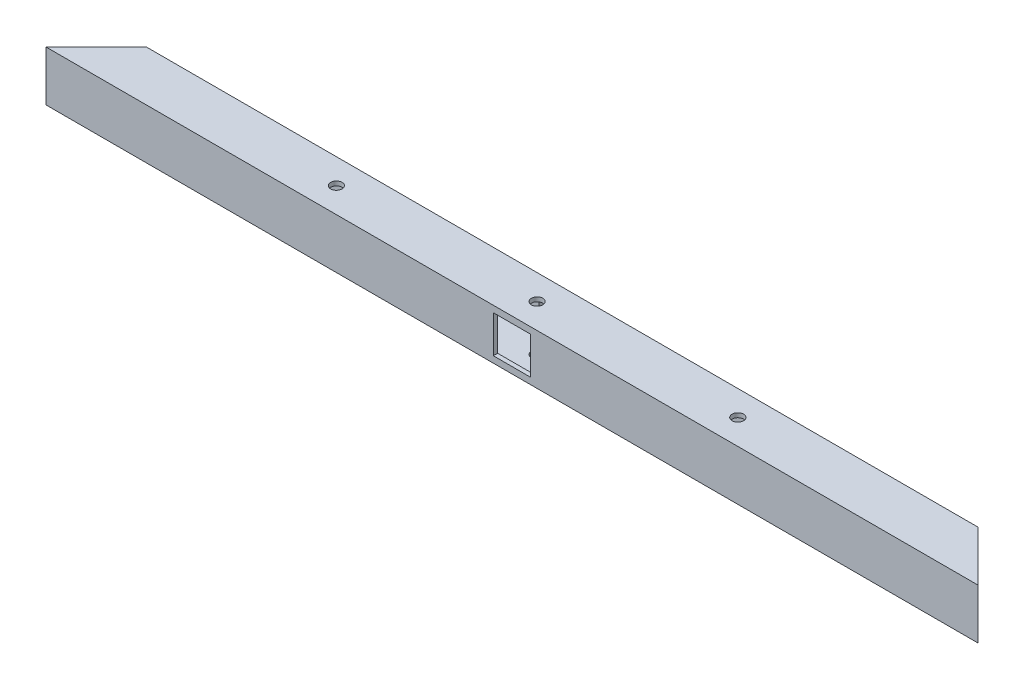
ISO-10303-21;
HEADER;
FILE_DESCRIPTION(('STEP AP214'),'2;1');
FILE_NAME('part.step','',(''),(''),'','','');
FILE_SCHEMA(('AUTOMOTIVE_DESIGN { 1 0 10303 214 1 1 1 1 }'));
ENDSEC;
DATA;
#1=APPLICATION_CONTEXT('core data for automotive mechanical design processes');
#2=APPLICATION_PROTOCOL_DEFINITION('international standard','automotive_design',2000,#1);
#3=PRODUCT_CONTEXT('',#1,'mechanical');
#4=PRODUCT('Part','Part','',(#3));
#5=PRODUCT_RELATED_PRODUCT_CATEGORY('part','',(#4));
#6=PRODUCT_DEFINITION_FORMATION('','',#4);
#7=PRODUCT_DEFINITION_CONTEXT('part definition',#1,'design');
#8=PRODUCT_DEFINITION('design','',#6,#7);
#9=PRODUCT_DEFINITION_SHAPE('','',#8);
#10=(LENGTH_UNIT() NAMED_UNIT(*) SI_UNIT(.MILLI.,.METRE.));
#11=(NAMED_UNIT(*) PLANE_ANGLE_UNIT() SI_UNIT($,.RADIAN.));
#12=(NAMED_UNIT(*) SI_UNIT($,.STERADIAN.) SOLID_ANGLE_UNIT());
#13=UNCERTAINTY_MEASURE_WITH_UNIT(LENGTH_MEASURE(1.E-05),#10,'distance_accuracy_value','');
#14=(GEOMETRIC_REPRESENTATION_CONTEXT(3) GLOBAL_UNCERTAINTY_ASSIGNED_CONTEXT((#13)) GLOBAL_UNIT_ASSIGNED_CONTEXT((#10,
#11,#12)) REPRESENTATION_CONTEXT('',''));
#15=CARTESIAN_POINT('',(0.,0.,0.));
#16=DIRECTION('',(0.,0.,1.));
#17=DIRECTION('',(1.,0.,0.));
#18=AXIS2_PLACEMENT_3D('',#15,#16,#17);
#19=CARTESIAN_POINT('',(325.,35.,12.5));
#20=DIRECTION('',(-0.707106781186543,0.,0.707106781186552));
#21=DIRECTION('',(0.707106781186552,0.,0.707106781186543));
#22=AXIS2_PLACEMENT_3D('',#19,#20,#21);
#23=PLANE('',#22);
#24=DIRECTION('',(-0.707106781186552,0.,-0.707106781186543));
#25=VECTOR('',#24,1.);
#26=CARTESIAN_POINT('',(325.,0.,12.5));
#27=LINE('',#26,#25);
#28=CARTESIAN_POINT('',(325.,0.,12.5));
#29=VERTEX_POINT('',#28);
#30=CARTESIAN_POINT('',(290.,0.,-22.5));
#31=VERTEX_POINT('',#30);
#32=EDGE_CURVE('E235',#29,#31,#27,.T.);
#33=ORIENTED_EDGE('',*,*,#32,.T.);
#34=DIRECTION('',(0.,-1.,0.));
#35=VECTOR('',#34,1.);
#36=CARTESIAN_POINT('',(290.,35.,-22.5));
#37=LINE('',#36,#35);
#38=CARTESIAN_POINT('',(290.,35.,-22.5));
#39=VERTEX_POINT('',#38);
#40=EDGE_CURVE('E268',#39,#31,#37,.T.);
#41=ORIENTED_EDGE('',*,*,#40,.F.);
#42=DIRECTION('',(-0.707106781186552,0.,-0.707106781186543));
#43=VECTOR('',#42,1.);
#44=CARTESIAN_POINT('',(325.,35.,12.5));
#45=LINE('',#44,#43);
#46=CARTESIAN_POINT('',(325.,35.,12.5));
#47=VERTEX_POINT('',#46);
#48=EDGE_CURVE('E242',#47,#39,#45,.T.);
#49=ORIENTED_EDGE('',*,*,#48,.F.);
#50=DIRECTION('',(0.,-1.,0.));
#51=VECTOR('',#50,1.);
#52=CARTESIAN_POINT('',(325.,35.,12.5));
#53=LINE('',#52,#51);
#54=EDGE_CURVE('E252',#47,#29,#53,.T.);
#55=ORIENTED_EDGE('',*,*,#54,.T.);
#56=EDGE_LOOP('',(#33,#41,#49,#55));
#57=FACE_BOUND('',#56,.T.);
#58=DIRECTION('',(-0.707106781186552,0.,-0.707106781186543));
#59=VECTOR('',#58,1.);
#60=CARTESIAN_POINT('',(156.249999999998,3.,-156.25));
#61=LINE('',#60,#59);
#62=CARTESIAN_POINT('',(322.,3.,9.50000000000001));
#63=VERTEX_POINT('',#62);
#64=CARTESIAN_POINT('',(293.,3.,-19.5));
#65=VERTEX_POINT('',#64);
#66=EDGE_CURVE('E208',#63,#65,#61,.T.);
#67=ORIENTED_EDGE('',*,*,#66,.F.);
#68=DIRECTION('',(0.,-1.,0.));
#69=VECTOR('',#68,1.);
#70=CARTESIAN_POINT('',(322.,35.,9.50000000000001));
#71=LINE('',#70,#69);
#72=CARTESIAN_POINT('',(322.,32.,9.50000000000001));
#73=VERTEX_POINT('',#72);
#74=EDGE_CURVE('E220',#73,#63,#71,.T.);
#75=ORIENTED_EDGE('',*,*,#74,.F.);
#76=DIRECTION('',(-0.707106781186552,0.,-0.707106781186543));
#77=VECTOR('',#76,1.);
#78=CARTESIAN_POINT('',(156.249999999998,32.,-156.25));
#79=LINE('',#78,#77);
#80=CARTESIAN_POINT('',(293.,32.,-19.5));
#81=VERTEX_POINT('',#80);
#82=EDGE_CURVE('E216',#73,#81,#79,.T.);
#83=ORIENTED_EDGE('',*,*,#82,.T.);
#84=DIRECTION('',(0.,-1.,0.));
#85=VECTOR('',#84,1.);
#86=CARTESIAN_POINT('',(293.,35.,-19.5));
#87=LINE('',#86,#85);
#88=EDGE_CURVE('E226',#81,#65,#87,.T.);
#89=ORIENTED_EDGE('',*,*,#88,.T.);
#90=EDGE_LOOP('',(#67,#75,#83,#89));
#91=FACE_BOUND('',#90,.T.);
#92=ADVANCED_FACE('F37',(#57,#91),#23,.F.);
#93=CARTESIAN_POINT('',(-325.,35.,12.5));
#94=DIRECTION('',(0.707106781186549,0.,0.707106781186546));
#95=DIRECTION('',(0.707106781186546,0.,-0.707106781186549));
#96=AXIS2_PLACEMENT_3D('',#93,#94,#95);
#97=PLANE('',#96);
#98=DIRECTION('',(-0.707106781186546,0.,0.707106781186549));
#99=VECTOR('',#98,1.);
#100=CARTESIAN_POINT('',(-325.,0.,12.5));
#101=LINE('',#100,#99);
#102=CARTESIAN_POINT('',(-290.,0.,-22.5));
#103=VERTEX_POINT('',#102);
#104=CARTESIAN_POINT('',(-325.,0.,12.5));
#105=VERTEX_POINT('',#104);
#106=EDGE_CURVE('E257',#103,#105,#101,.T.);
#107=ORIENTED_EDGE('',*,*,#106,.T.);
#108=DIRECTION('',(0.,-1.,0.));
#109=VECTOR('',#108,1.);
#110=CARTESIAN_POINT('',(-325.,35.,12.5));
#111=LINE('',#110,#109);
#112=CARTESIAN_POINT('',(-325.,35.,12.5));
#113=VERTEX_POINT('',#112);
#114=EDGE_CURVE('E262',#113,#105,#111,.T.);
#115=ORIENTED_EDGE('',*,*,#114,.F.);
#116=DIRECTION('',(-0.707106781186546,0.,0.707106781186549));
#117=VECTOR('',#116,1.);
#118=CARTESIAN_POINT('',(-325.,35.,12.5));
#119=LINE('',#118,#117);
#120=CARTESIAN_POINT('',(-290.,35.,-22.5));
#121=VERTEX_POINT('',#120);
#122=EDGE_CURVE('E248',#121,#113,#119,.T.);
#123=ORIENTED_EDGE('',*,*,#122,.F.);
#124=DIRECTION('',(0.,-1.,0.));
#125=VECTOR('',#124,1.);
#126=CARTESIAN_POINT('',(-290.,35.,-22.5));
#127=LINE('',#126,#125);
#128=EDGE_CURVE('E265',#121,#103,#127,.T.);
#129=ORIENTED_EDGE('',*,*,#128,.T.);
#130=EDGE_LOOP('',(#107,#115,#123,#129));
#131=FACE_BOUND('',#130,.T.);
#132=DIRECTION('',(-0.707106781186546,0.,0.707106781186549));
#133=VECTOR('',#132,1.);
#134=CARTESIAN_POINT('',(-156.250000000001,3.,-156.25));
#135=LINE('',#134,#133);
#136=CARTESIAN_POINT('',(-293.,3.,-19.5));
#137=VERTEX_POINT('',#136);
#138=CARTESIAN_POINT('',(-322.,3.,9.50000000000001));
#139=VERTEX_POINT('',#138);
#140=EDGE_CURVE('E211',#137,#139,#135,.T.);
#141=ORIENTED_EDGE('',*,*,#140,.F.);
#142=DIRECTION('',(0.,-1.,0.));
#143=VECTOR('',#142,1.);
#144=CARTESIAN_POINT('',(-293.,35.,-19.5));
#145=LINE('',#144,#143);
#146=CARTESIAN_POINT('',(-293.,32.,-19.5));
#147=VERTEX_POINT('',#146);
#148=EDGE_CURVE('E223',#147,#137,#145,.T.);
#149=ORIENTED_EDGE('',*,*,#148,.F.);
#150=DIRECTION('',(-0.707106781186546,0.,0.707106781186549));
#151=VECTOR('',#150,1.);
#152=CARTESIAN_POINT('',(-156.250000000001,32.,-156.25));
#153=LINE('',#152,#151);
#154=CARTESIAN_POINT('',(-322.,32.,9.50000000000001));
#155=VERTEX_POINT('',#154);
#156=EDGE_CURVE('E215',#147,#155,#153,.T.);
#157=ORIENTED_EDGE('',*,*,#156,.T.);
#158=DIRECTION('',(0.,-1.,0.));
#159=VECTOR('',#158,1.);
#160=CARTESIAN_POINT('',(-322.,35.,9.50000000000001));
#161=LINE('',#160,#159);
#162=EDGE_CURVE('E227',#155,#139,#161,.T.);
#163=ORIENTED_EDGE('',*,*,#162,.T.);
#164=EDGE_LOOP('',(#141,#149,#157,#163));
#165=FACE_BOUND('',#164,.T.);
#166=ADVANCED_FACE('F333',(#131,#165),#97,.F.);
#167=CARTESIAN_POINT('',(-290.,35.,-22.5));
#168=DIRECTION('',(0.,0.,1.));
#169=DIRECTION('',(1.,0.,0.));
#170=AXIS2_PLACEMENT_3D('',#167,#168,#169);
#171=PLANE('',#170);
#172=DIRECTION('',(1.,0.,0.));
#173=VECTOR('',#172,1.);
#174=CARTESIAN_POINT('',(-12.9999999999998,4.5,-22.5));
#175=LINE('',#174,#173);
#176=CARTESIAN_POINT('',(-12.9999999999998,4.5,-22.5));
#177=VERTEX_POINT('',#176);
#178=CARTESIAN_POINT('',(13.0000000000002,4.5,-22.5));
#179=VERTEX_POINT('',#178);
#180=EDGE_CURVE('E175',#177,#179,#175,.T.);
#181=ORIENTED_EDGE('',*,*,#180,.T.);
#182=DIRECTION('',(0.,1.,0.));
#183=VECTOR('',#182,1.);
#184=CARTESIAN_POINT('',(13.0000000000002,30.5,-22.5));
#185=LINE('',#184,#183);
#186=CARTESIAN_POINT('',(13.0000000000002,30.5,-22.5));
#187=VERTEX_POINT('',#186);
#188=EDGE_CURVE('E157',#179,#187,#185,.T.);
#189=ORIENTED_EDGE('',*,*,#188,.T.);
#190=DIRECTION('',(-1.,0.,0.));
#191=VECTOR('',#190,1.);
#192=CARTESIAN_POINT('',(-12.9999999999998,30.5,-22.5));
#193=LINE('',#192,#191);
#194=CARTESIAN_POINT('',(-12.9999999999998,30.5,-22.5));
#195=VERTEX_POINT('',#194);
#196=EDGE_CURVE('E167',#187,#195,#193,.T.);
#197=ORIENTED_EDGE('',*,*,#196,.T.);
#198=DIRECTION('',(0.,-1.,0.));
#199=VECTOR('',#198,1.);
#200=CARTESIAN_POINT('',(-12.9999999999998,30.5,-22.5));
#201=LINE('',#200,#199);
#202=EDGE_CURVE('E53',#195,#177,#201,.T.);
#203=ORIENTED_EDGE('',*,*,#202,.T.);
#204=EDGE_LOOP('',(#181,#189,#197,#203));
#205=FACE_BOUND('',#204,.T.);
#206=DIRECTION('',(-1.,0.,0.));
#207=VECTOR('',#206,1.);
#208=CARTESIAN_POINT('',(-290.,0.,-22.5));
#209=LINE('',#208,#207);
#210=EDGE_CURVE('E255',#31,#103,#209,.T.);
#211=ORIENTED_EDGE('',*,*,#210,.T.);
#212=ORIENTED_EDGE('',*,*,#128,.F.);
#213=DIRECTION('',(-1.,0.,0.));
#214=VECTOR('',#213,1.);
#215=CARTESIAN_POINT('',(-290.,35.,-22.5));
#216=LINE('',#215,#214);
#217=EDGE_CURVE('E245',#39,#121,#216,.T.);
#218=ORIENTED_EDGE('',*,*,#217,.F.);
#219=ORIENTED_EDGE('',*,*,#40,.T.);
#220=EDGE_LOOP('',(#211,#212,#218,#219));
#221=FACE_BOUND('',#220,.T.);
#222=ADVANCED_FACE('F172',(#205,#221),#171,.F.);
#223=CARTESIAN_POINT('',(-325.,35.,12.5));
#224=DIRECTION('',(0.,0.,-1.));
#225=DIRECTION('',(-1.,0.,0.));
#226=AXIS2_PLACEMENT_3D('',#223,#224,#225);
#227=PLANE('',#226);
#228=DIRECTION('',(-1.,0.,0.));
#229=VECTOR('',#228,1.);
#230=CARTESIAN_POINT('',(-12.9999999999998,30.5,12.5));
#231=LINE('',#230,#229);
#232=CARTESIAN_POINT('',(13.0000000000002,30.5,12.5));
#233=VERTEX_POINT('',#232);
#234=CARTESIAN_POINT('',(-12.9999999999998,30.5,12.5));
#235=VERTEX_POINT('',#234);
#236=EDGE_CURVE('E188',#233,#235,#231,.T.);
#237=ORIENTED_EDGE('',*,*,#236,.F.);
#238=DIRECTION('',(0.,1.,0.));
#239=VECTOR('',#238,1.);
#240=CARTESIAN_POINT('',(13.0000000000002,30.5,12.5));
#241=LINE('',#240,#239);
#242=CARTESIAN_POINT('',(13.0000000000002,4.5,12.5));
#243=VERTEX_POINT('',#242);
#244=EDGE_CURVE('E61',#243,#233,#241,.T.);
#245=ORIENTED_EDGE('',*,*,#244,.F.);
#246=DIRECTION('',(1.,0.,0.));
#247=VECTOR('',#246,1.);
#248=CARTESIAN_POINT('',(-12.9999999999998,4.5,12.5));
#249=LINE('',#248,#247);
#250=CARTESIAN_POINT('',(-12.9999999999998,4.5,12.5));
#251=VERTEX_POINT('',#250);
#252=EDGE_CURVE('E176',#251,#243,#249,.T.);
#253=ORIENTED_EDGE('',*,*,#252,.F.);
#254=DIRECTION('',(0.,-1.,0.));
#255=VECTOR('',#254,1.);
#256=CARTESIAN_POINT('',(-12.9999999999998,30.5,12.5));
#257=LINE('',#256,#255);
#258=EDGE_CURVE('E179',#235,#251,#257,.T.);
#259=ORIENTED_EDGE('',*,*,#258,.F.);
#260=EDGE_LOOP('',(#237,#245,#253,#259));
#261=FACE_BOUND('',#260,.T.);
#262=DIRECTION('',(1.,0.,0.));
#263=VECTOR('',#262,1.);
#264=CARTESIAN_POINT('',(-325.,0.,12.5));
#265=LINE('',#264,#263);
#266=EDGE_CURVE('E246',#105,#29,#265,.T.);
#267=ORIENTED_EDGE('',*,*,#266,.T.);
#268=ORIENTED_EDGE('',*,*,#54,.F.);
#269=DIRECTION('',(1.,0.,0.));
#270=VECTOR('',#269,1.);
#271=CARTESIAN_POINT('',(-325.,35.,12.5));
#272=LINE('',#271,#270);
#273=EDGE_CURVE('E250',#113,#47,#272,.T.);
#274=ORIENTED_EDGE('',*,*,#273,.F.);
#275=ORIENTED_EDGE('',*,*,#114,.T.);
#276=EDGE_LOOP('',(#267,#268,#274,#275));
#277=FACE_BOUND('',#276,.T.);
#278=ADVANCED_FACE('F384',(#261,#277),#227,.F.);
#279=CARTESIAN_POINT('',(0.,35.,0.));
#280=DIRECTION('',(0.,-1.,0.));
#281=DIRECTION('',(0.,0.,-1.));
#282=AXIS2_PLACEMENT_3D('',#279,#280,#281);
#283=PLANE('',#282);
#284=CARTESIAN_POINT('',(-140.,35.,-5.));
#285=DIRECTION('',(0.,1.,0.));
#286=DIRECTION('',(0.,0.,1.));
#287=AXIS2_PLACEMENT_3D('',#284,#285,#286);
#288=CIRCLE('',#287,3.99999999999999);
#289=CARTESIAN_POINT('',(-140.,35.,-1.00000000000001));
#290=VERTEX_POINT('',#289);
#291=EDGE_CURVE('E298',#290,#290,#288,.T.);
#292=ORIENTED_EDGE('',*,*,#291,.F.);
#293=EDGE_LOOP('',(#292));
#294=FACE_BOUND('',#293,.T.);
#295=CARTESIAN_POINT('',(140.,35.,-5.));
#296=DIRECTION('',(0.,1.,0.));
#297=DIRECTION('',(0.,0.,1.));
#298=AXIS2_PLACEMENT_3D('',#295,#296,#297);
#299=CIRCLE('',#298,3.99999999999999);
#300=CARTESIAN_POINT('',(140.,35.,-1.00000000000001));
#301=VERTEX_POINT('',#300);
#302=EDGE_CURVE('E304',#301,#301,#299,.T.);
#303=ORIENTED_EDGE('',*,*,#302,.F.);
#304=EDGE_LOOP('',(#303));
#305=FACE_BOUND('',#304,.T.);
#306=CARTESIAN_POINT('',(0.,35.,-5.));
#307=DIRECTION('',(0.,1.,0.));
#308=DIRECTION('',(0.,0.,1.));
#309=AXIS2_PLACEMENT_3D('',#306,#307,#308);
#310=CIRCLE('',#309,4.);
#311=CARTESIAN_POINT('',(0.,35.,-0.999999999999997));
#312=VERTEX_POINT('',#311);
#313=EDGE_CURVE('E292',#312,#312,#310,.T.);
#314=ORIENTED_EDGE('',*,*,#313,.F.);
#315=EDGE_LOOP('',(#314));
#316=FACE_BOUND('',#315,.T.);
#317=ORIENTED_EDGE('',*,*,#48,.T.);
#318=ORIENTED_EDGE('',*,*,#217,.T.);
#319=ORIENTED_EDGE('',*,*,#122,.T.);
#320=ORIENTED_EDGE('',*,*,#273,.T.);
#321=EDGE_LOOP('',(#317,#318,#319,#320));
#322=FACE_BOUND('',#321,.T.);
#323=ADVANCED_FACE('F369',(#294,#305,#316,#322),#283,.F.);
#324=CARTESIAN_POINT('',(0.,0.,0.));
#325=DIRECTION('',(0.,-1.,0.));
#326=DIRECTION('',(0.,0.,-1.));
#327=AXIS2_PLACEMENT_3D('',#324,#325,#326);
#328=PLANE('',#327);
#329=CARTESIAN_POINT('',(-140.,0.,-5.));
#330=DIRECTION('',(0.,1.,0.));
#331=DIRECTION('',(0.,0.,1.));
#332=AXIS2_PLACEMENT_3D('',#329,#330,#331);
#333=CIRCLE('',#332,3.99999999999999);
#334=CARTESIAN_POINT('',(-140.,0.,-1.00000000000001));
#335=VERTEX_POINT('',#334);
#336=EDGE_CURVE('E301',#335,#335,#333,.T.);
#337=ORIENTED_EDGE('',*,*,#336,.T.);
#338=EDGE_LOOP('',(#337));
#339=FACE_BOUND('',#338,.T.);
#340=CARTESIAN_POINT('',(140.,0.,-5.));
#341=DIRECTION('',(0.,1.,0.));
#342=DIRECTION('',(0.,0.,1.));
#343=AXIS2_PLACEMENT_3D('',#340,#341,#342);
#344=CIRCLE('',#343,3.99999999999999);
#345=CARTESIAN_POINT('',(140.,0.,-1.00000000000001));
#346=VERTEX_POINT('',#345);
#347=EDGE_CURVE('E295',#346,#346,#344,.T.);
#348=ORIENTED_EDGE('',*,*,#347,.T.);
#349=EDGE_LOOP('',(#348));
#350=FACE_BOUND('',#349,.T.);
#351=CARTESIAN_POINT('',(0.,0.,-5.));
#352=DIRECTION('',(0.,1.,0.));
#353=DIRECTION('',(0.,0.,1.));
#354=AXIS2_PLACEMENT_3D('',#351,#352,#353);
#355=CIRCLE('',#354,4.);
#356=CARTESIAN_POINT('',(0.,0.,-0.999999999999997));
#357=VERTEX_POINT('',#356);
#358=EDGE_CURVE('E280',#357,#357,#355,.T.);
#359=ORIENTED_EDGE('',*,*,#358,.T.);
#360=EDGE_LOOP('',(#359));
#361=FACE_BOUND('',#360,.T.);
#362=ORIENTED_EDGE('',*,*,#32,.F.);
#363=ORIENTED_EDGE('',*,*,#266,.F.);
#364=ORIENTED_EDGE('',*,*,#106,.F.);
#365=ORIENTED_EDGE('',*,*,#210,.F.);
#366=EDGE_LOOP('',(#362,#363,#364,#365));
#367=FACE_BOUND('',#366,.T.);
#368=ADVANCED_FACE('F310',(#339,#350,#361,#367),#328,.T.);
#369=CARTESIAN_POINT('',(-290.,35.,-19.5));
#370=DIRECTION('',(0.,0.,1.));
#371=DIRECTION('',(1.,0.,0.));
#372=AXIS2_PLACEMENT_3D('',#369,#370,#371);
#373=PLANE('',#372);
#374=DIRECTION('',(0.,1.,0.));
#375=VECTOR('',#374,1.);
#376=CARTESIAN_POINT('',(13.0000000000002,35.,-19.5));
#377=LINE('',#376,#375);
#378=CARTESIAN_POINT('',(13.0000000000002,4.5,-19.5));
#379=VERTEX_POINT('',#378);
#380=CARTESIAN_POINT('',(13.0000000000002,30.5,-19.5));
#381=VERTEX_POINT('',#380);
#382=EDGE_CURVE('E160',#379,#381,#377,.T.);
#383=ORIENTED_EDGE('',*,*,#382,.F.);
#384=DIRECTION('',(1.,0.,0.));
#385=VECTOR('',#384,1.);
#386=CARTESIAN_POINT('',(-290.,4.5,-19.5));
#387=LINE('',#386,#385);
#388=CARTESIAN_POINT('',(-12.9999999999998,4.5,-19.5));
#389=VERTEX_POINT('',#388);
#390=EDGE_CURVE('E205',#389,#379,#387,.T.);
#391=ORIENTED_EDGE('',*,*,#390,.F.);
#392=DIRECTION('',(0.,-1.,0.));
#393=VECTOR('',#392,1.);
#394=CARTESIAN_POINT('',(-12.9999999999998,35.,-19.5));
#395=LINE('',#394,#393);
#396=CARTESIAN_POINT('',(-12.9999999999998,30.5,-19.5));
#397=VERTEX_POINT('',#396);
#398=EDGE_CURVE('E203',#397,#389,#395,.T.);
#399=ORIENTED_EDGE('',*,*,#398,.F.);
#400=DIRECTION('',(-1.,0.,0.));
#401=VECTOR('',#400,1.);
#402=CARTESIAN_POINT('',(-290.,30.5,-19.5));
#403=LINE('',#402,#401);
#404=EDGE_CURVE('E195',#381,#397,#403,.T.);
#405=ORIENTED_EDGE('',*,*,#404,.F.);
#406=EDGE_LOOP('',(#383,#391,#399,#405));
#407=FACE_BOUND('',#406,.T.);
#408=DIRECTION('',(-1.,0.,0.));
#409=VECTOR('',#408,1.);
#410=CARTESIAN_POINT('',(0.,3.,-19.5));
#411=LINE('',#410,#409);
#412=EDGE_CURVE('E209',#65,#137,#411,.T.);
#413=ORIENTED_EDGE('',*,*,#412,.F.);
#414=ORIENTED_EDGE('',*,*,#88,.F.);
#415=DIRECTION('',(-1.,0.,0.));
#416=VECTOR('',#415,1.);
#417=CARTESIAN_POINT('',(0.,32.,-19.5));
#418=LINE('',#417,#416);
#419=EDGE_CURVE('E212',#81,#147,#418,.T.);
#420=ORIENTED_EDGE('',*,*,#419,.T.);
#421=ORIENTED_EDGE('',*,*,#148,.T.);
#422=EDGE_LOOP('',(#413,#414,#420,#421));
#423=FACE_BOUND('',#422,.T.);
#424=ADVANCED_FACE('F358',(#407,#423),#373,.T.);
#425=CARTESIAN_POINT('',(-325.,35.,9.50000000000001));
#426=DIRECTION('',(0.,0.,-1.));
#427=DIRECTION('',(-1.,0.,0.));
#428=AXIS2_PLACEMENT_3D('',#425,#426,#427);
#429=PLANE('',#428);
#430=DIRECTION('',(0.,-1.,0.));
#431=VECTOR('',#430,1.);
#432=CARTESIAN_POINT('',(13.0000000000002,35.,9.50000000000001));
#433=LINE('',#432,#431);
#434=CARTESIAN_POINT('',(13.0000000000002,30.5,9.5));
#435=VERTEX_POINT('',#434);
#436=CARTESIAN_POINT('',(13.0000000000002,4.5,9.5));
#437=VERTEX_POINT('',#436);
#438=EDGE_CURVE('E11',#435,#437,#433,.T.);
#439=ORIENTED_EDGE('',*,*,#438,.F.);
#440=DIRECTION('',(1.,0.,0.));
#441=VECTOR('',#440,1.);
#442=CARTESIAN_POINT('',(-325.,30.5,9.50000000000001));
#443=LINE('',#442,#441);
#444=CARTESIAN_POINT('',(-12.9999999999998,30.5,9.50000000000001));
#445=VERTEX_POINT('',#444);
#446=EDGE_CURVE('E271',#445,#435,#443,.T.);
#447=ORIENTED_EDGE('',*,*,#446,.F.);
#448=DIRECTION('',(0.,1.,0.));
#449=VECTOR('',#448,1.);
#450=CARTESIAN_POINT('',(-12.9999999999998,35.,9.50000000000001));
#451=LINE('',#450,#449);
#452=CARTESIAN_POINT('',(-12.9999999999998,4.5,9.5));
#453=VERTEX_POINT('',#452);
#454=EDGE_CURVE('E273',#453,#445,#451,.T.);
#455=ORIENTED_EDGE('',*,*,#454,.F.);
#456=DIRECTION('',(-1.,0.,0.));
#457=VECTOR('',#456,1.);
#458=CARTESIAN_POINT('',(-325.,4.5,9.50000000000001));
#459=LINE('',#458,#457);
#460=EDGE_CURVE('E45',#437,#453,#459,.T.);
#461=ORIENTED_EDGE('',*,*,#460,.F.);
#462=EDGE_LOOP('',(#439,#447,#455,#461));
#463=FACE_BOUND('',#462,.T.);
#464=DIRECTION('',(1.,0.,0.));
#465=VECTOR('',#464,1.);
#466=CARTESIAN_POINT('',(0.,3.,9.50000000000001));
#467=LINE('',#466,#465);
#468=EDGE_CURVE('E221',#139,#63,#467,.T.);
#469=ORIENTED_EDGE('',*,*,#468,.F.);
#470=ORIENTED_EDGE('',*,*,#162,.F.);
#471=DIRECTION('',(1.,0.,0.));
#472=VECTOR('',#471,1.);
#473=CARTESIAN_POINT('',(0.,32.,9.50000000000001));
#474=LINE('',#473,#472);
#475=EDGE_CURVE('E217',#155,#73,#474,.T.);
#476=ORIENTED_EDGE('',*,*,#475,.T.);
#477=ORIENTED_EDGE('',*,*,#74,.T.);
#478=EDGE_LOOP('',(#469,#470,#476,#477));
#479=FACE_BOUND('',#478,.T.);
#480=ADVANCED_FACE('F351',(#463,#479),#429,.T.);
#481=CARTESIAN_POINT('',(0.,32.,0.));
#482=DIRECTION('',(0.,-1.,0.));
#483=DIRECTION('',(0.,0.,-1.));
#484=AXIS2_PLACEMENT_3D('',#481,#482,#483);
#485=PLANE('',#484);
#486=CARTESIAN_POINT('',(-140.,32.,-5.));
#487=DIRECTION('',(0.,-1.,0.));
#488=DIRECTION('',(0.,0.,-1.));
#489=AXIS2_PLACEMENT_3D('',#486,#487,#488);
#490=CIRCLE('',#489,3.99999999999999);
#491=CARTESIAN_POINT('',(-140.,32.,-8.99999999999999));
#492=VERTEX_POINT('',#491);
#493=EDGE_CURVE('E182',#492,#492,#490,.T.);
#494=ORIENTED_EDGE('',*,*,#493,.F.);
#495=EDGE_LOOP('',(#494));
#496=FACE_BOUND('',#495,.T.);
#497=CARTESIAN_POINT('',(140.,32.,-5.));
#498=DIRECTION('',(0.,-1.,0.));
#499=DIRECTION('',(0.,0.,-1.));
#500=AXIS2_PLACEMENT_3D('',#497,#498,#499);
#501=CIRCLE('',#500,3.99999999999999);
#502=CARTESIAN_POINT('',(140.,32.,-8.99999999999999));
#503=VERTEX_POINT('',#502);
#504=EDGE_CURVE('E283',#503,#503,#501,.T.);
#505=ORIENTED_EDGE('',*,*,#504,.F.);
#506=EDGE_LOOP('',(#505));
#507=FACE_BOUND('',#506,.T.);
#508=CARTESIAN_POINT('',(0.,32.,-5.));
#509=DIRECTION('',(0.,-1.,0.));
#510=DIRECTION('',(0.,0.,-1.));
#511=AXIS2_PLACEMENT_3D('',#508,#509,#510);
#512=CIRCLE('',#511,4.);
#513=CARTESIAN_POINT('',(0.,32.,-9.));
#514=VERTEX_POINT('',#513);
#515=EDGE_CURVE('E279',#514,#514,#512,.T.);
#516=ORIENTED_EDGE('',*,*,#515,.F.);
#517=EDGE_LOOP('',(#516));
#518=FACE_BOUND('',#517,.T.);
#519=ORIENTED_EDGE('',*,*,#82,.F.);
#520=ORIENTED_EDGE('',*,*,#475,.F.);
#521=ORIENTED_EDGE('',*,*,#156,.F.);
#522=ORIENTED_EDGE('',*,*,#419,.F.);
#523=EDGE_LOOP('',(#519,#520,#521,#522));
#524=FACE_BOUND('',#523,.T.);
#525=ADVANCED_FACE('F354',(#496,#507,#518,#524),#485,.T.);
#526=CARTESIAN_POINT('',(0.,3.,0.));
#527=DIRECTION('',(0.,-1.,0.));
#528=DIRECTION('',(0.,0.,-1.));
#529=AXIS2_PLACEMENT_3D('',#526,#527,#528);
#530=PLANE('',#529);
#531=CARTESIAN_POINT('',(-140.,3.,-5.));
#532=DIRECTION('',(0.,-1.,0.));
#533=DIRECTION('',(0.,0.,-1.));
#534=AXIS2_PLACEMENT_3D('',#531,#532,#533);
#535=CIRCLE('',#534,3.99999999999999);
#536=CARTESIAN_POINT('',(-140.,3.,-8.99999999999999));
#537=VERTEX_POINT('',#536);
#538=EDGE_CURVE('E40',#537,#537,#535,.T.);
#539=ORIENTED_EDGE('',*,*,#538,.T.);
#540=EDGE_LOOP('',(#539));
#541=FACE_BOUND('',#540,.T.);
#542=CARTESIAN_POINT('',(140.,3.,-5.));
#543=DIRECTION('',(0.,-1.,0.));
#544=DIRECTION('',(0.,0.,-1.));
#545=AXIS2_PLACEMENT_3D('',#542,#543,#544);
#546=CIRCLE('',#545,3.99999999999999);
#547=CARTESIAN_POINT('',(140.,3.,-8.99999999999999));
#548=VERTEX_POINT('',#547);
#549=EDGE_CURVE('E281',#548,#548,#546,.T.);
#550=ORIENTED_EDGE('',*,*,#549,.T.);
#551=EDGE_LOOP('',(#550));
#552=FACE_BOUND('',#551,.T.);
#553=CARTESIAN_POINT('',(0.,3.,-5.));
#554=DIRECTION('',(0.,-1.,0.));
#555=DIRECTION('',(0.,0.,-1.));
#556=AXIS2_PLACEMENT_3D('',#553,#554,#555);
#557=CIRCLE('',#556,4.);
#558=CARTESIAN_POINT('',(0.,3.,-9.));
#559=VERTEX_POINT('',#558);
#560=EDGE_CURVE('E277',#559,#559,#557,.T.);
#561=ORIENTED_EDGE('',*,*,#560,.T.);
#562=EDGE_LOOP('',(#561));
#563=FACE_BOUND('',#562,.T.);
#564=ORIENTED_EDGE('',*,*,#66,.T.);
#565=ORIENTED_EDGE('',*,*,#412,.T.);
#566=ORIENTED_EDGE('',*,*,#140,.T.);
#567=ORIENTED_EDGE('',*,*,#468,.T.);
#568=EDGE_LOOP('',(#564,#565,#566,#567));
#569=FACE_BOUND('',#568,.T.);
#570=ADVANCED_FACE('F347',(#541,#552,#563,#569),#530,.F.);
#571=CARTESIAN_POINT('',(-12.9999999999998,30.5,-22.5));
#572=DIRECTION('',(0.,1.,0.));
#573=DIRECTION('',(0.,0.,1.));
#574=AXIS2_PLACEMENT_3D('',#571,#572,#573);
#575=PLANE('',#574);
#576=ORIENTED_EDGE('',*,*,#446,.T.);
#577=DIRECTION('',(0.,0.,1.));
#578=VECTOR('',#577,1.);
#579=CARTESIAN_POINT('',(13.0000000000002,30.5,-22.5));
#580=LINE('',#579,#578);
#581=EDGE_CURVE('E164',#435,#233,#580,.T.);
#582=ORIENTED_EDGE('',*,*,#581,.T.);
#583=ORIENTED_EDGE('',*,*,#236,.T.);
#584=DIRECTION('',(0.,0.,1.));
#585=VECTOR('',#584,1.);
#586=CARTESIAN_POINT('',(-12.9999999999998,30.5,-22.5));
#587=LINE('',#586,#585);
#588=EDGE_CURVE('E163',#445,#235,#587,.T.);
#589=ORIENTED_EDGE('',*,*,#588,.F.);
#590=EDGE_LOOP('',(#576,#582,#583,#589));
#591=FACE_BOUND('',#590,.T.);
#592=ADVANCED_FACE('F381',(#591),#575,.F.);
#593=CARTESIAN_POINT('',(-12.9999999999998,30.5,-22.5));
#594=DIRECTION('',(-1.,0.,0.));
#595=DIRECTION('',(0.,-1.,0.));
#596=AXIS2_PLACEMENT_3D('',#593,#594,#595);
#597=PLANE('',#596);
#598=ORIENTED_EDGE('',*,*,#454,.T.);
#599=ORIENTED_EDGE('',*,*,#588,.T.);
#600=ORIENTED_EDGE('',*,*,#258,.T.);
#601=DIRECTION('',(0.,0.,1.));
#602=VECTOR('',#601,1.);
#603=CARTESIAN_POINT('',(-12.9999999999998,4.5,-22.5));
#604=LINE('',#603,#602);
#605=EDGE_CURVE('E200',#453,#251,#604,.T.);
#606=ORIENTED_EDGE('',*,*,#605,.F.);
#607=EDGE_LOOP('',(#598,#599,#600,#606));
#608=FACE_BOUND('',#607,.T.);
#609=ADVANCED_FACE('F444',(#608),#597,.F.);
#610=CARTESIAN_POINT('',(-12.9999999999998,4.5,-22.5));
#611=DIRECTION('',(0.,-1.,0.));
#612=DIRECTION('',(0.,0.,-1.));
#613=AXIS2_PLACEMENT_3D('',#610,#611,#612);
#614=PLANE('',#613);
#615=ORIENTED_EDGE('',*,*,#460,.T.);
#616=ORIENTED_EDGE('',*,*,#605,.T.);
#617=ORIENTED_EDGE('',*,*,#252,.T.);
#618=DIRECTION('',(0.,0.,1.));
#619=VECTOR('',#618,1.);
#620=CARTESIAN_POINT('',(13.0000000000002,4.5,-22.5));
#621=LINE('',#620,#619);
#622=EDGE_CURVE('E196',#437,#243,#621,.T.);
#623=ORIENTED_EDGE('',*,*,#622,.F.);
#624=EDGE_LOOP('',(#615,#616,#617,#623));
#625=FACE_BOUND('',#624,.T.);
#626=ADVANCED_FACE('F450',(#625),#614,.F.);
#627=CARTESIAN_POINT('',(13.0000000000002,30.5,-22.5));
#628=DIRECTION('',(1.,0.,0.));
#629=DIRECTION('',(0.,1.,0.));
#630=AXIS2_PLACEMENT_3D('',#627,#628,#629);
#631=PLANE('',#630);
#632=ORIENTED_EDGE('',*,*,#438,.T.);
#633=ORIENTED_EDGE('',*,*,#622,.T.);
#634=ORIENTED_EDGE('',*,*,#244,.T.);
#635=ORIENTED_EDGE('',*,*,#581,.F.);
#636=EDGE_LOOP('',(#632,#633,#634,#635));
#637=FACE_BOUND('',#636,.T.);
#638=ADVANCED_FACE('F373',(#637),#631,.F.);
#639=ORIENTED_EDGE('',*,*,#382,.T.);
#640=EDGE_CURVE('E152',#187,#381,#580,.T.);
#641=ORIENTED_EDGE('',*,*,#640,.F.);
#642=ORIENTED_EDGE('',*,*,#188,.F.);
#643=EDGE_CURVE('E193',#179,#379,#621,.T.);
#644=ORIENTED_EDGE('',*,*,#643,.T.);
#645=EDGE_LOOP('',(#639,#641,#642,#644));
#646=FACE_BOUND('',#645,.T.);
#647=ADVANCED_FACE('F154',(#646),#631,.F.);
#648=ORIENTED_EDGE('',*,*,#390,.T.);
#649=ORIENTED_EDGE('',*,*,#643,.F.);
#650=ORIENTED_EDGE('',*,*,#180,.F.);
#651=EDGE_CURVE('E197',#177,#389,#604,.T.);
#652=ORIENTED_EDGE('',*,*,#651,.T.);
#653=EDGE_LOOP('',(#648,#649,#650,#652));
#654=FACE_BOUND('',#653,.T.);
#655=ADVANCED_FACE('F461',(#654),#614,.F.);
#656=ORIENTED_EDGE('',*,*,#398,.T.);
#657=ORIENTED_EDGE('',*,*,#651,.F.);
#658=ORIENTED_EDGE('',*,*,#202,.F.);
#659=EDGE_CURVE('E169',#195,#397,#587,.T.);
#660=ORIENTED_EDGE('',*,*,#659,.T.);
#661=EDGE_LOOP('',(#656,#657,#658,#660));
#662=FACE_BOUND('',#661,.T.);
#663=ADVANCED_FACE('F453',(#662),#597,.F.);
#664=ORIENTED_EDGE('',*,*,#404,.T.);
#665=ORIENTED_EDGE('',*,*,#659,.F.);
#666=ORIENTED_EDGE('',*,*,#196,.F.);
#667=ORIENTED_EDGE('',*,*,#640,.T.);
#668=EDGE_LOOP('',(#664,#665,#666,#667));
#669=FACE_BOUND('',#668,.T.);
#670=ADVANCED_FACE('F168',(#669),#575,.F.);
#671=CARTESIAN_POINT('',(0.,0.,-5.));
#672=DIRECTION('',(0.,1.,0.));
#673=DIRECTION('',(0.,0.,1.));
#674=AXIS2_PLACEMENT_3D('',#671,#672,#673);
#675=CYLINDRICAL_SURFACE('',#674,4.);
#676=ORIENTED_EDGE('',*,*,#358,.F.);
#677=EDGE_LOOP('',(#676));
#678=FACE_BOUND('',#677,.T.);
#679=ORIENTED_EDGE('',*,*,#560,.F.);
#680=EDGE_LOOP('',(#679));
#681=FACE_BOUND('',#680,.T.);
#682=ADVANCED_FACE('F317',(#678,#681),#675,.F.);
#683=CARTESIAN_POINT('',(140.,0.,-5.));
#684=DIRECTION('',(0.,1.,0.));
#685=DIRECTION('',(0.,0.,1.));
#686=AXIS2_PLACEMENT_3D('',#683,#684,#685);
#687=CYLINDRICAL_SURFACE('',#686,3.99999999999999);
#688=ORIENTED_EDGE('',*,*,#347,.F.);
#689=EDGE_LOOP('',(#688));
#690=FACE_BOUND('',#689,.T.);
#691=ORIENTED_EDGE('',*,*,#549,.F.);
#692=EDGE_LOOP('',(#691));
#693=FACE_BOUND('',#692,.T.);
#694=ADVANCED_FACE('F313',(#690,#693),#687,.F.);
#695=CARTESIAN_POINT('',(-140.,0.,-5.));
#696=DIRECTION('',(0.,1.,0.));
#697=DIRECTION('',(0.,0.,1.));
#698=AXIS2_PLACEMENT_3D('',#695,#696,#697);
#699=CYLINDRICAL_SURFACE('',#698,3.99999999999999);
#700=ORIENTED_EDGE('',*,*,#336,.F.);
#701=EDGE_LOOP('',(#700));
#702=FACE_BOUND('',#701,.T.);
#703=ORIENTED_EDGE('',*,*,#538,.F.);
#704=EDGE_LOOP('',(#703));
#705=FACE_BOUND('',#704,.T.);
#706=ADVANCED_FACE('F316',(#702,#705),#699,.F.);
#707=ORIENTED_EDGE('',*,*,#515,.T.);
#708=EDGE_LOOP('',(#707));
#709=FACE_BOUND('',#708,.T.);
#710=ORIENTED_EDGE('',*,*,#313,.T.);
#711=EDGE_LOOP('',(#710));
#712=FACE_BOUND('',#711,.T.);
#713=ADVANCED_FACE('F324',(#709,#712),#675,.F.);
#714=ORIENTED_EDGE('',*,*,#504,.T.);
#715=EDGE_LOOP('',(#714));
#716=FACE_BOUND('',#715,.T.);
#717=ORIENTED_EDGE('',*,*,#302,.T.);
#718=EDGE_LOOP('',(#717));
#719=FACE_BOUND('',#718,.T.);
#720=ADVANCED_FACE('F319',(#716,#719),#687,.F.);
#721=ORIENTED_EDGE('',*,*,#493,.T.);
#722=EDGE_LOOP('',(#721));
#723=FACE_BOUND('',#722,.T.);
#724=ORIENTED_EDGE('',*,*,#291,.T.);
#725=EDGE_LOOP('',(#724));
#726=FACE_BOUND('',#725,.T.);
#727=ADVANCED_FACE('F327',(#723,#726),#699,.F.);
#728=CLOSED_SHELL('',(#92,#166,#222,#278,#323,#368,#424,#480,#525,#570,#592,#609,#626,#638,#647,
#655,#663,#670,#682,#694,#706,#713,#720,#727));
#729=MANIFOLD_SOLID_BREP('B2',#728);
#730=ADVANCED_BREP_SHAPE_REPRESENTATION('',(#18,#729),#14);
#731=SHAPE_DEFINITION_REPRESENTATION(#9,#730);
ENDSEC;
END-ISO-10303-21;
